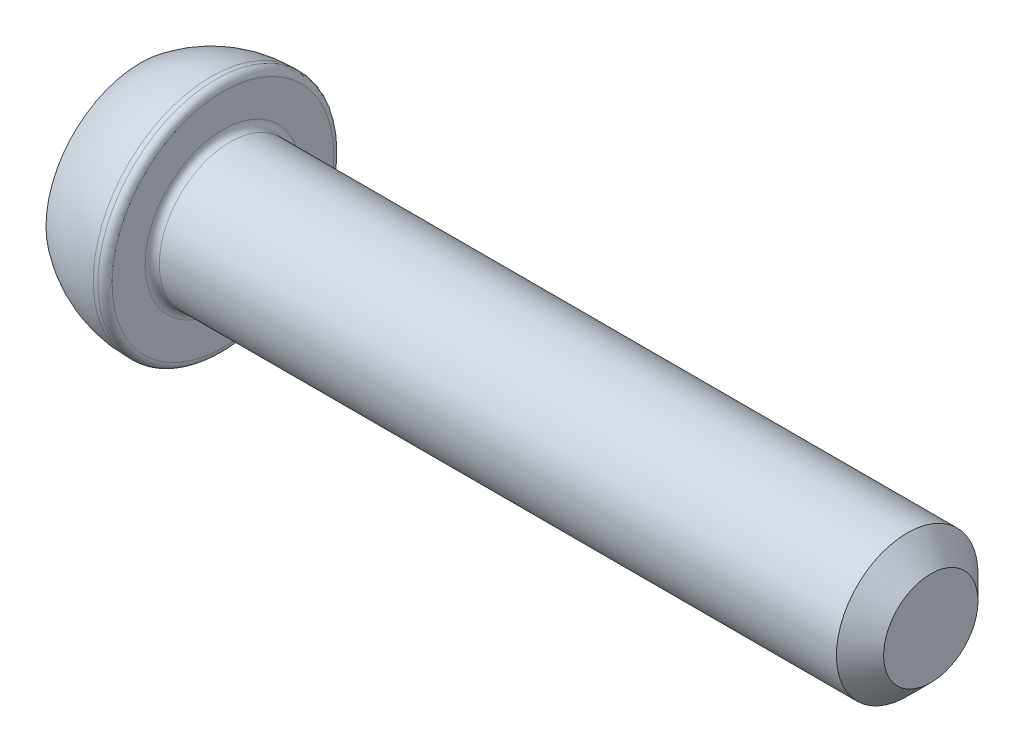
ISO-10303-21;
HEADER;
FILE_DESCRIPTION(('STEP AP214'),'2;1');
FILE_NAME('part.step','',(''),(''),'','','');
FILE_SCHEMA(('AUTOMOTIVE_DESIGN { 1 0 10303 214 1 1 1 1 }'));
ENDSEC;
DATA;
#1=APPLICATION_CONTEXT('core data for automotive mechanical design processes');
#2=APPLICATION_PROTOCOL_DEFINITION('international standard','automotive_design',2000,#1);
#3=PRODUCT_CONTEXT('',#1,'mechanical');
#4=PRODUCT('Part','Part','',(#3));
#5=PRODUCT_RELATED_PRODUCT_CATEGORY('part','',(#4));
#6=PRODUCT_DEFINITION_FORMATION('','',#4);
#7=PRODUCT_DEFINITION_CONTEXT('part definition',#1,'design');
#8=PRODUCT_DEFINITION('design','',#6,#7);
#9=PRODUCT_DEFINITION_SHAPE('','',#8);
#10=(LENGTH_UNIT() NAMED_UNIT(*) SI_UNIT(.MILLI.,.METRE.));
#11=(NAMED_UNIT(*) PLANE_ANGLE_UNIT() SI_UNIT($,.RADIAN.));
#12=(NAMED_UNIT(*) SI_UNIT($,.STERADIAN.) SOLID_ANGLE_UNIT());
#13=UNCERTAINTY_MEASURE_WITH_UNIT(LENGTH_MEASURE(1.E-05),#10,'distance_accuracy_value','');
#14=(GEOMETRIC_REPRESENTATION_CONTEXT(3) GLOBAL_UNCERTAINTY_ASSIGNED_CONTEXT((#13)) GLOBAL_UNIT_ASSIGNED_CONTEXT((#10,
#11,#12)) REPRESENTATION_CONTEXT('',''));
#15=CARTESIAN_POINT('',(0.,0.,0.));
#16=DIRECTION('',(0.,0.,1.));
#17=DIRECTION('',(1.,0.,0.));
#18=AXIS2_PLACEMENT_3D('',#15,#16,#17);
#19=CARTESIAN_POINT('',(0.,0.,0.));
#20=DIRECTION('',(-1.,0.,0.));
#21=DIRECTION('',(0.,-1.,0.));
#22=AXIS2_PLACEMENT_3D('',#19,#20,#21);
#23=PLANE('',#22);
#24=DIRECTION('',(0.,0.866025403784438,-0.5));
#25=VECTOR('',#24,1.);
#26=CARTESIAN_POINT('',(0.,0.,2.3094010767585));
#27=LINE('',#26,#25);
#28=CARTESIAN_POINT('',(0.,0.,2.3094010767585));
#29=VERTEX_POINT('',#28);
#30=CARTESIAN_POINT('',(0.,2.,1.15470053837925));
#31=VERTEX_POINT('',#30);
#32=EDGE_CURVE('E54',#29,#31,#27,.T.);
#33=ORIENTED_EDGE('',*,*,#32,.F.);
#34=DIRECTION('',(0.,0.866025403784439,0.5));
#35=VECTOR('',#34,1.);
#36=CARTESIAN_POINT('',(0.,-2.,1.15470053837925));
#37=LINE('',#36,#35);
#38=CARTESIAN_POINT('',(0.,-2.,1.15470053837925));
#39=VERTEX_POINT('',#38);
#40=EDGE_CURVE('E137',#39,#29,#37,.T.);
#41=ORIENTED_EDGE('',*,*,#40,.F.);
#42=DIRECTION('',(0.,0.,1.));
#43=VECTOR('',#42,1.);
#44=CARTESIAN_POINT('',(0.,-2.,-1.15470053837925));
#45=LINE('',#44,#43);
#46=CARTESIAN_POINT('',(0.,-2.,-1.15470053837925));
#47=VERTEX_POINT('',#46);
#48=EDGE_CURVE('E135',#47,#39,#45,.T.);
#49=ORIENTED_EDGE('',*,*,#48,.F.);
#50=DIRECTION('',(0.,-0.866025403784439,0.5));
#51=VECTOR('',#50,1.);
#52=CARTESIAN_POINT('',(0.,0.,-2.3094010767585));
#53=LINE('',#52,#51);
#54=CARTESIAN_POINT('',(0.,0.,-2.3094010767585));
#55=VERTEX_POINT('',#54);
#56=EDGE_CURVE('E102',#55,#47,#53,.T.);
#57=ORIENTED_EDGE('',*,*,#56,.F.);
#58=DIRECTION('',(0.,-0.866025403784439,-0.5));
#59=VECTOR('',#58,1.);
#60=CARTESIAN_POINT('',(0.,2.,-1.15470053837925));
#61=LINE('',#60,#59);
#62=CARTESIAN_POINT('',(0.,2.,-1.15470053837925));
#63=VERTEX_POINT('',#62);
#64=EDGE_CURVE('E131',#63,#55,#61,.T.);
#65=ORIENTED_EDGE('',*,*,#64,.F.);
#66=DIRECTION('',(0.,0.,-1.));
#67=VECTOR('',#66,1.);
#68=CARTESIAN_POINT('',(0.,2.,1.15470053837925));
#69=LINE('',#68,#67);
#70=EDGE_CURVE('E128',#31,#63,#69,.T.);
#71=ORIENTED_EDGE('',*,*,#70,.F.);
#72=EDGE_LOOP('',(#33,#41,#49,#57,#65,#71));
#73=FACE_BOUND('',#72,.T.);
#74=CARTESIAN_POINT('',(0.,0.,0.));
#75=DIRECTION('',(1.,0.,0.));
#76=DIRECTION('',(0.,1.,0.));
#77=AXIS2_PLACEMENT_3D('',#74,#75,#76);
#78=CIRCLE('',#77,4.);
#79=CARTESIAN_POINT('',(0.,4.,0.));
#80=VERTEX_POINT('',#79);
#81=EDGE_CURVE('E149',#80,#80,#78,.T.);
#82=ORIENTED_EDGE('',*,*,#81,.F.);
#83=EDGE_LOOP('',(#82));
#84=FACE_BOUND('',#83,.T.);
#85=ADVANCED_FACE('F38',(#73,#84),#23,.T.);
#86=CARTESIAN_POINT('',(3.,0.,0.));
#87=DIRECTION('',(1.,0.,0.));
#88=DIRECTION('',(0.,1.,0.));
#89=AXIS2_PLACEMENT_3D('',#86,#87,#88);
#90=SPHERICAL_SURFACE('',#89,5.);
#91=ORIENTED_EDGE('',*,*,#81,.T.);
#92=EDGE_LOOP('',(#91));
#93=FACE_BOUND('',#92,.T.);
#94=CARTESIAN_POINT('',(3.,0.,0.));
#95=DIRECTION('',(1.,0.,0.));
#96=DIRECTION('',(0.,1.,0.));
#97=AXIS2_PLACEMENT_3D('',#94,#95,#96);
#98=CIRCLE('',#97,5.);
#99=CARTESIAN_POINT('',(3.,5.,0.));
#100=VERTEX_POINT('',#99);
#101=EDGE_CURVE('E141',#100,#100,#98,.T.);
#102=ORIENTED_EDGE('',*,*,#101,.F.);
#103=EDGE_LOOP('',(#102));
#104=FACE_BOUND('',#103,.T.);
#105=ADVANCED_FACE('F178',(#93,#104),#90,.T.);
#106=CARTESIAN_POINT('',(33.5,0.,0.));
#107=DIRECTION('',(1.,0.,0.));
#108=DIRECTION('',(0.,1.,0.));
#109=AXIS2_PLACEMENT_3D('',#106,#107,#108);
#110=CYLINDRICAL_SURFACE('',#109,5.);
#111=CARTESIAN_POINT('',(3.2,0.,0.));
#112=DIRECTION('',(1.,0.,0.));
#113=DIRECTION('',(0.,1.,0.));
#114=AXIS2_PLACEMENT_3D('',#111,#112,#113);
#115=CIRCLE('',#114,5.);
#116=CARTESIAN_POINT('',(3.2,5.,0.));
#117=VERTEX_POINT('',#116);
#118=EDGE_CURVE('E161',#117,#117,#115,.F.);
#119=ORIENTED_EDGE('',*,*,#118,.T.);
#120=EDGE_LOOP('',(#119));
#121=FACE_BOUND('',#120,.T.);
#122=ORIENTED_EDGE('',*,*,#101,.T.);
#123=EDGE_LOOP('',(#122));
#124=FACE_BOUND('',#123,.T.);
#125=ADVANCED_FACE('F184',(#121,#124),#110,.T.);
#126=CARTESIAN_POINT('',(3.5,5.,0.));
#127=DIRECTION('',(1.,0.,0.));
#128=DIRECTION('',(0.,1.,0.));
#129=AXIS2_PLACEMENT_3D('',#126,#127,#128);
#130=PLANE('',#129);
#131=CARTESIAN_POINT('',(3.5,0.,0.));
#132=DIRECTION('',(1.,0.,0.));
#133=DIRECTION('',(0.,1.,0.));
#134=AXIS2_PLACEMENT_3D('',#131,#132,#133);
#135=CIRCLE('',#134,3.3);
#136=CARTESIAN_POINT('',(3.5,3.3,0.));
#137=VERTEX_POINT('',#136);
#138=EDGE_CURVE('E158',#137,#137,#135,.F.);
#139=ORIENTED_EDGE('',*,*,#138,.T.);
#140=EDGE_LOOP('',(#139));
#141=FACE_BOUND('',#140,.T.);
#142=CARTESIAN_POINT('',(3.5,0.,0.));
#143=DIRECTION('',(1.,0.,0.));
#144=DIRECTION('',(0.,1.,0.));
#145=AXIS2_PLACEMENT_3D('',#142,#143,#144);
#146=CIRCLE('',#145,4.7);
#147=CARTESIAN_POINT('',(3.5,4.7,0.));
#148=VERTEX_POINT('',#147);
#149=EDGE_CURVE('E155',#148,#148,#146,.T.);
#150=ORIENTED_EDGE('',*,*,#149,.T.);
#151=EDGE_LOOP('',(#150));
#152=FACE_BOUND('',#151,.T.);
#153=ADVANCED_FACE('F203',(#141,#152),#130,.T.);
#154=CARTESIAN_POINT('',(33.5,0.,0.));
#155=DIRECTION('',(1.,0.,0.));
#156=DIRECTION('',(0.,1.,0.));
#157=AXIS2_PLACEMENT_3D('',#154,#155,#156);
#158=CYLINDRICAL_SURFACE('',#157,3.);
#159=CARTESIAN_POINT('',(32.5,0.,0.));
#160=DIRECTION('',(1.,0.,0.));
#161=DIRECTION('',(0.,1.,0.));
#162=AXIS2_PLACEMENT_3D('',#159,#160,#161);
#163=CIRCLE('',#162,3.);
#164=CARTESIAN_POINT('',(32.5,3.,0.));
#165=VERTEX_POINT('',#164);
#166=EDGE_CURVE('E11',#165,#165,#163,.F.);
#167=ORIENTED_EDGE('',*,*,#166,.T.);
#168=EDGE_LOOP('',(#167));
#169=FACE_BOUND('',#168,.T.);
#170=CARTESIAN_POINT('',(3.8,0.,0.));
#171=DIRECTION('',(1.,0.,0.));
#172=DIRECTION('',(0.,1.,0.));
#173=AXIS2_PLACEMENT_3D('',#170,#171,#172);
#174=CIRCLE('',#173,3.);
#175=CARTESIAN_POINT('',(3.8,3.,0.));
#176=VERTEX_POINT('',#175);
#177=EDGE_CURVE('E152',#176,#176,#174,.T.);
#178=ORIENTED_EDGE('',*,*,#177,.T.);
#179=EDGE_LOOP('',(#178));
#180=FACE_BOUND('',#179,.T.);
#181=ADVANCED_FACE('F201',(#169,#180),#158,.T.);
#182=CARTESIAN_POINT('',(33.5,3.,0.));
#183=DIRECTION('',(1.,0.,0.));
#184=DIRECTION('',(0.,1.,0.));
#185=AXIS2_PLACEMENT_3D('',#182,#183,#184);
#186=PLANE('',#185);
#187=CARTESIAN_POINT('',(33.5,0.,0.));
#188=DIRECTION('',(1.,0.,0.));
#189=DIRECTION('',(0.,1.,0.));
#190=AXIS2_PLACEMENT_3D('',#187,#188,#189);
#191=CIRCLE('',#190,1.99999999999999);
#192=CARTESIAN_POINT('',(33.5,2.,0.));
#193=VERTEX_POINT('',#192);
#194=EDGE_CURVE('E47',#193,#193,#191,.T.);
#195=ORIENTED_EDGE('',*,*,#194,.T.);
#196=EDGE_LOOP('',(#195));
#197=FACE_BOUND('',#196,.T.);
#198=ADVANCED_FACE('F166',(#197),#186,.T.);
#199=CARTESIAN_POINT('',(2.,0.,2.3094010767585));
#200=DIRECTION('',(0.,0.5,0.866025403784439));
#201=DIRECTION('',(0.,-0.866025403784438,0.5));
#202=AXIS2_PLACEMENT_3D('',#199,#200,#201);
#203=PLANE('',#202);
#204=ORIENTED_EDGE('',*,*,#32,.T.);
#205=DIRECTION('',(-1.,0.,0.));
#206=VECTOR('',#205,1.);
#207=CARTESIAN_POINT('',(2.,2.,1.15470053837925));
#208=LINE('',#207,#206);
#209=CARTESIAN_POINT('',(2.,2.,1.15470053837925));
#210=VERTEX_POINT('',#209);
#211=EDGE_CURVE('E84',#210,#31,#208,.T.);
#212=ORIENTED_EDGE('',*,*,#211,.F.);
#213=DIRECTION('',(0.,0.866025403784438,-0.5));
#214=VECTOR('',#213,1.);
#215=CARTESIAN_POINT('',(2.,0.,2.3094010767585));
#216=LINE('',#215,#214);
#217=CARTESIAN_POINT('',(2.,0.,2.3094010767585));
#218=VERTEX_POINT('',#217);
#219=EDGE_CURVE('E139',#218,#210,#216,.T.);
#220=ORIENTED_EDGE('',*,*,#219,.F.);
#221=DIRECTION('',(-1.,0.,0.));
#222=VECTOR('',#221,1.);
#223=CARTESIAN_POINT('',(2.,0.,2.3094010767585));
#224=LINE('',#223,#222);
#225=EDGE_CURVE('E62',#218,#29,#224,.T.);
#226=ORIENTED_EDGE('',*,*,#225,.T.);
#227=EDGE_LOOP('',(#204,#212,#220,#226));
#228=FACE_BOUND('',#227,.T.);
#229=ADVANCED_FACE('F210',(#228),#203,.F.);
#230=CARTESIAN_POINT('',(2.,-2.,1.15470053837925));
#231=DIRECTION('',(0.,-0.5,0.866025403784439));
#232=DIRECTION('',(0.,-0.866025403784439,-0.5));
#233=AXIS2_PLACEMENT_3D('',#230,#231,#232);
#234=PLANE('',#233);
#235=ORIENTED_EDGE('',*,*,#40,.T.);
#236=ORIENTED_EDGE('',*,*,#225,.F.);
#237=DIRECTION('',(0.,0.866025403784439,0.5));
#238=VECTOR('',#237,1.);
#239=CARTESIAN_POINT('',(2.,-2.,1.15470053837925));
#240=LINE('',#239,#238);
#241=CARTESIAN_POINT('',(2.,-2.,1.15470053837925));
#242=VERTEX_POINT('',#241);
#243=EDGE_CURVE('E114',#242,#218,#240,.T.);
#244=ORIENTED_EDGE('',*,*,#243,.F.);
#245=DIRECTION('',(-1.,0.,0.));
#246=VECTOR('',#245,1.);
#247=CARTESIAN_POINT('',(2.,-2.,1.15470053837925));
#248=LINE('',#247,#246);
#249=EDGE_CURVE('E106',#242,#39,#248,.T.);
#250=ORIENTED_EDGE('',*,*,#249,.T.);
#251=EDGE_LOOP('',(#235,#236,#244,#250));
#252=FACE_BOUND('',#251,.T.);
#253=ADVANCED_FACE('F269',(#252),#234,.F.);
#254=CARTESIAN_POINT('',(2.,-2.,-1.15470053837925));
#255=DIRECTION('',(0.,-1.,0.));
#256=DIRECTION('',(0.,0.,-1.));
#257=AXIS2_PLACEMENT_3D('',#254,#255,#256);
#258=PLANE('',#257);
#259=ORIENTED_EDGE('',*,*,#48,.T.);
#260=ORIENTED_EDGE('',*,*,#249,.F.);
#261=DIRECTION('',(0.,0.,1.));
#262=VECTOR('',#261,1.);
#263=CARTESIAN_POINT('',(2.,-2.,-1.15470053837925));
#264=LINE('',#263,#262);
#265=CARTESIAN_POINT('',(2.,-2.,-1.15470053837925));
#266=VERTEX_POINT('',#265);
#267=EDGE_CURVE('E110',#266,#242,#264,.T.);
#268=ORIENTED_EDGE('',*,*,#267,.F.);
#269=DIRECTION('',(-1.,0.,0.));
#270=VECTOR('',#269,1.);
#271=CARTESIAN_POINT('',(2.,-2.,-1.15470053837925));
#272=LINE('',#271,#270);
#273=EDGE_CURVE('E95',#266,#47,#272,.T.);
#274=ORIENTED_EDGE('',*,*,#273,.T.);
#275=EDGE_LOOP('',(#259,#260,#268,#274));
#276=FACE_BOUND('',#275,.T.);
#277=ADVANCED_FACE('F111',(#276),#258,.F.);
#278=CARTESIAN_POINT('',(2.,0.,-2.3094010767585));
#279=DIRECTION('',(0.,-0.5,-0.866025403784439));
#280=DIRECTION('',(0.,0.866025403784439,-0.5));
#281=AXIS2_PLACEMENT_3D('',#278,#279,#280);
#282=PLANE('',#281);
#283=ORIENTED_EDGE('',*,*,#56,.T.);
#284=ORIENTED_EDGE('',*,*,#273,.F.);
#285=DIRECTION('',(0.,-0.866025403784439,0.5));
#286=VECTOR('',#285,1.);
#287=CARTESIAN_POINT('',(2.,0.,-2.3094010767585));
#288=LINE('',#287,#286);
#289=CARTESIAN_POINT('',(2.,0.,-2.3094010767585));
#290=VERTEX_POINT('',#289);
#291=EDGE_CURVE('E99',#290,#266,#288,.T.);
#292=ORIENTED_EDGE('',*,*,#291,.F.);
#293=DIRECTION('',(-1.,0.,0.));
#294=VECTOR('',#293,1.);
#295=CARTESIAN_POINT('',(2.,0.,-2.3094010767585));
#296=LINE('',#295,#294);
#297=EDGE_CURVE('E107',#290,#55,#296,.T.);
#298=ORIENTED_EDGE('',*,*,#297,.T.);
#299=EDGE_LOOP('',(#283,#284,#292,#298));
#300=FACE_BOUND('',#299,.T.);
#301=ADVANCED_FACE('F97',(#300),#282,.F.);
#302=CARTESIAN_POINT('',(2.,2.,-1.15470053837925));
#303=DIRECTION('',(0.,0.5,-0.866025403784439));
#304=DIRECTION('',(0.,0.866025403784439,0.5));
#305=AXIS2_PLACEMENT_3D('',#302,#303,#304);
#306=PLANE('',#305);
#307=ORIENTED_EDGE('',*,*,#64,.T.);
#308=ORIENTED_EDGE('',*,*,#297,.F.);
#309=DIRECTION('',(0.,-0.866025403784439,-0.5));
#310=VECTOR('',#309,1.);
#311=CARTESIAN_POINT('',(2.,2.,-1.15470053837925));
#312=LINE('',#311,#310);
#313=CARTESIAN_POINT('',(2.,2.,-1.15470053837925));
#314=VERTEX_POINT('',#313);
#315=EDGE_CURVE('E120',#314,#290,#312,.T.);
#316=ORIENTED_EDGE('',*,*,#315,.F.);
#317=DIRECTION('',(-1.,0.,0.));
#318=VECTOR('',#317,1.);
#319=CARTESIAN_POINT('',(2.,2.,-1.15470053837925));
#320=LINE('',#319,#318);
#321=EDGE_CURVE('E144',#314,#63,#320,.T.);
#322=ORIENTED_EDGE('',*,*,#321,.T.);
#323=EDGE_LOOP('',(#307,#308,#316,#322));
#324=FACE_BOUND('',#323,.T.);
#325=ADVANCED_FACE('F286',(#324),#306,.F.);
#326=CARTESIAN_POINT('',(2.,2.,1.15470053837925));
#327=DIRECTION('',(0.,1.,0.));
#328=DIRECTION('',(0.,0.,1.));
#329=AXIS2_PLACEMENT_3D('',#326,#327,#328);
#330=PLANE('',#329);
#331=ORIENTED_EDGE('',*,*,#70,.T.);
#332=ORIENTED_EDGE('',*,*,#321,.F.);
#333=DIRECTION('',(0.,0.,-1.));
#334=VECTOR('',#333,1.);
#335=CARTESIAN_POINT('',(2.,2.,1.15470053837925));
#336=LINE('',#335,#334);
#337=EDGE_CURVE('E122',#210,#314,#336,.T.);
#338=ORIENTED_EDGE('',*,*,#337,.F.);
#339=ORIENTED_EDGE('',*,*,#211,.T.);
#340=EDGE_LOOP('',(#331,#332,#338,#339));
#341=FACE_BOUND('',#340,.T.);
#342=ADVANCED_FACE('F195',(#341),#330,.F.);
#343=CARTESIAN_POINT('',(2.,0.,0.));
#344=DIRECTION('',(-1.,0.,0.));
#345=DIRECTION('',(0.,0.,1.));
#346=AXIS2_PLACEMENT_3D('',#343,#344,#345);
#347=PLANE('',#346);
#348=ORIENTED_EDGE('',*,*,#219,.T.);
#349=ORIENTED_EDGE('',*,*,#337,.T.);
#350=ORIENTED_EDGE('',*,*,#315,.T.);
#351=ORIENTED_EDGE('',*,*,#291,.T.);
#352=ORIENTED_EDGE('',*,*,#267,.T.);
#353=ORIENTED_EDGE('',*,*,#243,.T.);
#354=EDGE_LOOP('',(#348,#349,#350,#351,#352,#353));
#355=FACE_BOUND('',#354,.T.);
#356=ADVANCED_FACE('F117',(#355),#347,.T.);
#357=CARTESIAN_POINT('',(3.8,0.,0.));
#358=DIRECTION('',(1.,0.,0.));
#359=DIRECTION('',(0.,1.,0.));
#360=AXIS2_PLACEMENT_3D('',#357,#358,#359);
#361=TOROIDAL_SURFACE('',#360,3.3,0.3);
#362=ORIENTED_EDGE('',*,*,#138,.F.);
#363=EDGE_LOOP('',(#362));
#364=FACE_BOUND('',#363,.T.);
#365=ORIENTED_EDGE('',*,*,#177,.F.);
#366=EDGE_LOOP('',(#365));
#367=FACE_BOUND('',#366,.T.);
#368=ADVANCED_FACE('F174',(#364,#367),#361,.F.);
#369=CARTESIAN_POINT('',(3.2,0.,0.));
#370=DIRECTION('',(1.,0.,0.));
#371=DIRECTION('',(0.,1.,0.));
#372=AXIS2_PLACEMENT_3D('',#369,#370,#371);
#373=TOROIDAL_SURFACE('',#372,4.7,0.3);
#374=ORIENTED_EDGE('',*,*,#118,.F.);
#375=EDGE_LOOP('',(#374));
#376=FACE_BOUND('',#375,.T.);
#377=ORIENTED_EDGE('',*,*,#149,.F.);
#378=EDGE_LOOP('',(#377));
#379=FACE_BOUND('',#378,.T.);
#380=ADVANCED_FACE('F169',(#376,#379),#373,.T.);
#381=CARTESIAN_POINT('',(33.5,0.,0.));
#382=DIRECTION('',(-1.,0.,0.));
#383=DIRECTION('',(0.,-1.,0.));
#384=AXIS2_PLACEMENT_3D('',#381,#382,#383);
#385=CONICAL_SURFACE('',#384,1.99999999999999,0.785398163397445);
#386=ORIENTED_EDGE('',*,*,#166,.F.);
#387=EDGE_LOOP('',(#386));
#388=FACE_BOUND('',#387,.T.);
#389=ORIENTED_EDGE('',*,*,#194,.F.);
#390=EDGE_LOOP('',(#389));
#391=FACE_BOUND('',#390,.T.);
#392=ADVANCED_FACE('F41',(#388,#391),#385,.T.);
#393=CLOSED_SHELL('',(#85,#105,#125,#153,#181,#198,#229,#253,#277,#301,#325,#342,#356,#368,#380,#392));
#394=MANIFOLD_SOLID_BREP('B2',#393);
#395=ADVANCED_BREP_SHAPE_REPRESENTATION('',(#18,#394),#14);
#396=SHAPE_DEFINITION_REPRESENTATION(#9,#395);
ENDSEC;
END-ISO-10303-21;
